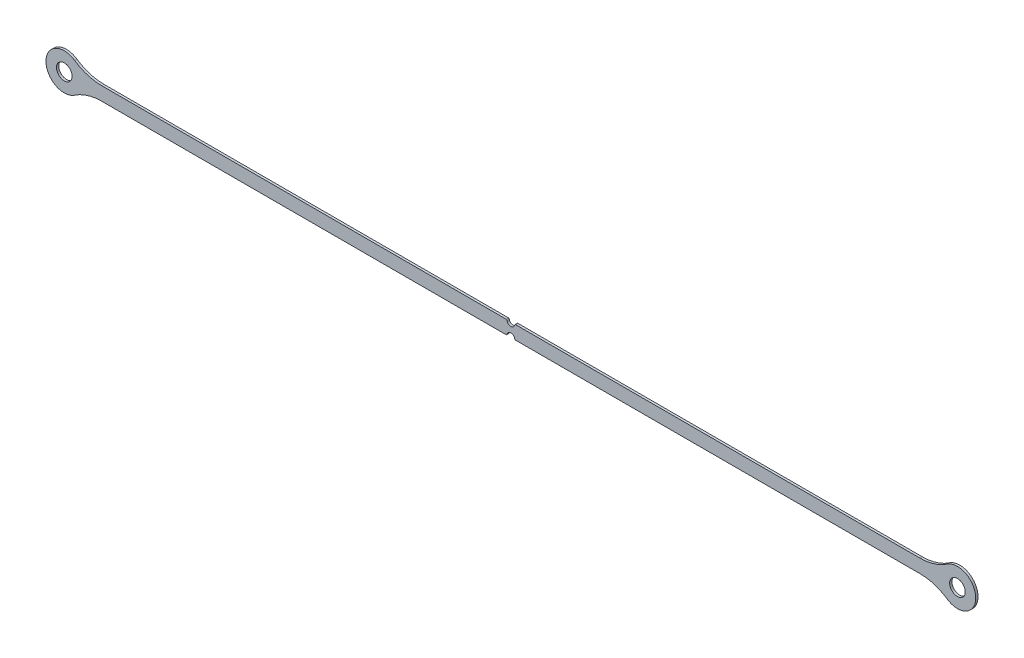
ISO-10303-21;
HEADER;
FILE_DESCRIPTION(('STEP AP214'),'2;1');
FILE_NAME('part.step','',(''),(''),'','','');
FILE_SCHEMA(('AUTOMOTIVE_DESIGN { 1 0 10303 214 1 1 1 1 }'));
ENDSEC;
DATA;
#1=APPLICATION_CONTEXT('core data for automotive mechanical design processes');
#2=APPLICATION_PROTOCOL_DEFINITION('international standard','automotive_design',2000,#1);
#3=PRODUCT_CONTEXT('',#1,'mechanical');
#4=PRODUCT('Part','Part','',(#3));
#5=PRODUCT_RELATED_PRODUCT_CATEGORY('part','',(#4));
#6=PRODUCT_DEFINITION_FORMATION('','',#4);
#7=PRODUCT_DEFINITION_CONTEXT('part definition',#1,'design');
#8=PRODUCT_DEFINITION('design','',#6,#7);
#9=PRODUCT_DEFINITION_SHAPE('','',#8);
#10=(LENGTH_UNIT() NAMED_UNIT(*) SI_UNIT(.MILLI.,.METRE.));
#11=(NAMED_UNIT(*) PLANE_ANGLE_UNIT() SI_UNIT($,.RADIAN.));
#12=(NAMED_UNIT(*) SI_UNIT($,.STERADIAN.) SOLID_ANGLE_UNIT());
#13=UNCERTAINTY_MEASURE_WITH_UNIT(LENGTH_MEASURE(1.E-05),#10,'distance_accuracy_value','');
#14=(GEOMETRIC_REPRESENTATION_CONTEXT(3) GLOBAL_UNCERTAINTY_ASSIGNED_CONTEXT((#13)) GLOBAL_UNIT_ASSIGNED_CONTEXT((#10,
#11,#12)) REPRESENTATION_CONTEXT('',''));
#15=CARTESIAN_POINT('',(0.,0.,0.));
#16=DIRECTION('',(0.,0.,1.));
#17=DIRECTION('',(1.,0.,0.));
#18=AXIS2_PLACEMENT_3D('',#15,#16,#17);
#19=CARTESIAN_POINT('',(-232.,0.,1.19999999999998));
#20=DIRECTION('',(0.,0.,-1.));
#21=DIRECTION('',(-1.,0.,0.));
#22=AXIS2_PLACEMENT_3D('',#19,#20,#21);
#23=CYLINDRICAL_SURFACE('',#22,9.49999999999999);
#24=CARTESIAN_POINT('',(-232.,0.,0.));
#25=DIRECTION('',(0.,0.,1.));
#26=DIRECTION('',(1.,0.,0.));
#27=AXIS2_PLACEMENT_3D('',#24,#25,#26);
#28=CIRCLE('',#27,9.49999999999999);
#29=CARTESIAN_POINT('',(-226.646344640446,-7.84782608695656,0.));
#30=VERTEX_POINT('',#29);
#31=CARTESIAN_POINT('',(-226.646344640446,7.84782608695644,-2.22044604925031E-13));
#32=VERTEX_POINT('',#31);
#33=EDGE_CURVE('E197',#30,#32,#28,.F.);
#34=ORIENTED_EDGE('',*,*,#33,.F.);
#35=DIRECTION('',(0.,0.,-1.));
#36=VECTOR('',#35,1.);
#37=CARTESIAN_POINT('',(-226.646344640446,-7.84782608695656,1.19999999999998));
#38=LINE('',#37,#36);
#39=CARTESIAN_POINT('',(-226.646344640446,-7.84782608695656,1.19999999999998));
#40=VERTEX_POINT('',#39);
#41=EDGE_CURVE('E13',#40,#30,#38,.T.);
#42=ORIENTED_EDGE('',*,*,#41,.F.);
#43=CARTESIAN_POINT('',(-232.,0.,1.19999999999998));
#44=DIRECTION('',(0.,0.,1.));
#45=DIRECTION('',(1.,0.,0.));
#46=AXIS2_PLACEMENT_3D('',#43,#44,#45);
#47=CIRCLE('',#46,9.49999999999999);
#48=CARTESIAN_POINT('',(-226.646344640446,7.84782608695644,1.19999999999987));
#49=VERTEX_POINT('',#48);
#50=EDGE_CURVE('E245',#40,#49,#47,.F.);
#51=ORIENTED_EDGE('',*,*,#50,.T.);
#52=DIRECTION('',(0.,0.,-1.));
#53=VECTOR('',#52,1.);
#54=CARTESIAN_POINT('',(-226.646344640446,7.84782608695644,1.19999999999987));
#55=LINE('',#54,#53);
#56=EDGE_CURVE('E63',#49,#32,#55,.T.);
#57=ORIENTED_EDGE('',*,*,#56,.T.);
#58=EDGE_LOOP('',(#34,#42,#51,#57));
#59=FACE_BOUND('',#58,.T.);
#60=ADVANCED_FACE('F47',(#59),#23,.T.);
#61=CARTESIAN_POINT('',(-212.557777904776,-28.5000000000001,1.19999999999998));
#62=DIRECTION('',(0.,0.,-1.));
#63=DIRECTION('',(-1.,0.,0.));
#64=AXIS2_PLACEMENT_3D('',#61,#62,#63);
#65=CYLINDRICAL_SURFACE('',#64,25.);
#66=CARTESIAN_POINT('',(-212.557777904776,-28.5000000000001,0.));
#67=DIRECTION('',(0.,0.,1.));
#68=DIRECTION('',(1.,0.,0.));
#69=AXIS2_PLACEMENT_3D('',#66,#67,#68);
#70=CIRCLE('',#69,25.);
#71=CARTESIAN_POINT('',(-212.557777904776,-3.50000000000006,0.));
#72=VERTEX_POINT('',#71);
#73=EDGE_CURVE('E199',#30,#72,#70,.F.);
#74=ORIENTED_EDGE('',*,*,#73,.T.);
#75=DIRECTION('',(0.,0.,-1.));
#76=VECTOR('',#75,1.);
#77=CARTESIAN_POINT('',(-212.557777904776,-3.50000000000006,1.19999999999998));
#78=LINE('',#77,#76);
#79=CARTESIAN_POINT('',(-212.557777904776,-3.50000000000006,1.19999999999998));
#80=VERTEX_POINT('',#79);
#81=EDGE_CURVE('E55',#80,#72,#78,.T.);
#82=ORIENTED_EDGE('',*,*,#81,.F.);
#83=CARTESIAN_POINT('',(-212.557777904776,-28.5000000000001,1.19999999999998));
#84=DIRECTION('',(0.,0.,1.));
#85=DIRECTION('',(1.,0.,0.));
#86=AXIS2_PLACEMENT_3D('',#83,#84,#85);
#87=CIRCLE('',#86,25.);
#88=EDGE_CURVE('E480',#40,#80,#87,.F.);
#89=ORIENTED_EDGE('',*,*,#88,.F.);
#90=ORIENTED_EDGE('',*,*,#41,.T.);
#91=EDGE_LOOP('',(#74,#82,#89,#90));
#92=FACE_BOUND('',#91,.T.);
#93=ADVANCED_FACE('F279',(#92),#65,.F.);
#94=CARTESIAN_POINT('',(0.,-3.5,1.19999999999998));
#95=DIRECTION('',(0.,-1.,0.));
#96=DIRECTION('',(1.,0.,0.));
#97=AXIS2_PLACEMENT_3D('',#94,#95,#96);
#98=PLANE('',#97);
#99=DIRECTION('',(-1.,0.,0.));
#100=VECTOR('',#99,1.);
#101=CARTESIAN_POINT('',(0.,-3.5,0.));
#102=LINE('',#101,#100);
#103=CARTESIAN_POINT('',(-2.50049995001,-3.5,0.));
#104=VERTEX_POINT('',#103);
#105=EDGE_CURVE('E202',#104,#72,#102,.T.);
#106=ORIENTED_EDGE('',*,*,#105,.F.);
#107=DIRECTION('',(0.,0.,-1.));
#108=VECTOR('',#107,1.);
#109=CARTESIAN_POINT('',(-2.50049995000996,-3.49999999999995,1.19999999999998));
#110=LINE('',#109,#108);
#111=CARTESIAN_POINT('',(-2.50049995000996,-3.49999999999995,1.19999999999998));
#112=VERTEX_POINT('',#111);
#113=EDGE_CURVE('E269',#112,#104,#110,.T.);
#114=ORIENTED_EDGE('',*,*,#113,.F.);
#115=DIRECTION('',(-1.,0.,0.));
#116=VECTOR('',#115,1.);
#117=CARTESIAN_POINT('',(0.,-3.5,1.19999999999998));
#118=LINE('',#117,#116);
#119=EDGE_CURVE('E276',#112,#80,#118,.T.);
#120=ORIENTED_EDGE('',*,*,#119,.T.);
#121=ORIENTED_EDGE('',*,*,#81,.T.);
#122=EDGE_LOOP('',(#106,#114,#120,#121));
#123=FACE_BOUND('',#122,.T.);
#124=ADVANCED_FACE('F274',(#123),#98,.T.);
#125=CARTESIAN_POINT('',(-2.50049995000999,-3.,1.19999999999998));
#126=DIRECTION('',(0.,0.,-1.));
#127=DIRECTION('',(-1.,0.,0.));
#128=AXIS2_PLACEMENT_3D('',#125,#126,#127);
#129=CYLINDRICAL_SURFACE('',#128,0.5);
#130=CARTESIAN_POINT('',(-2.50049995001,-3.,0.));
#131=DIRECTION('',(0.,0.,1.));
#132=DIRECTION('',(1.,0.,0.));
#133=AXIS2_PLACEMENT_3D('',#130,#131,#132);
#134=CIRCLE('',#133,0.5);
#135=CARTESIAN_POINT('',(-2.01020584216488,-3.0980392156863,0.));
#136=VERTEX_POINT('',#135);
#137=EDGE_CURVE('E205',#104,#136,#134,.T.);
#138=ORIENTED_EDGE('',*,*,#137,.T.);
#139=DIRECTION('',(0.,0.,-1.));
#140=VECTOR('',#139,1.);
#141=CARTESIAN_POINT('',(-2.01020584216487,-3.0980392156863,1.19999999999998));
#142=LINE('',#141,#140);
#143=CARTESIAN_POINT('',(-2.01020584216487,-3.0980392156863,1.19999999999998));
#144=VERTEX_POINT('',#143);
#145=EDGE_CURVE('E266',#144,#136,#142,.T.);
#146=ORIENTED_EDGE('',*,*,#145,.F.);
#147=CARTESIAN_POINT('',(-2.50049995000999,-3.,1.19999999999998));
#148=DIRECTION('',(0.,0.,1.));
#149=DIRECTION('',(1.,0.,0.));
#150=AXIS2_PLACEMENT_3D('',#147,#148,#149);
#151=CIRCLE('',#150,0.5);
#152=EDGE_CURVE('E297',#112,#144,#151,.T.);
#153=ORIENTED_EDGE('',*,*,#152,.F.);
#154=ORIENTED_EDGE('',*,*,#113,.T.);
#155=EDGE_LOOP('',(#138,#146,#153,#154));
#156=FACE_BOUND('',#155,.T.);
#157=ADVANCED_FACE('F287',(#156),#129,.T.);
#158=CARTESIAN_POINT('',(0.,-3.5,1.19999999999998));
#159=DIRECTION('',(0.,0.,-1.));
#160=DIRECTION('',(-1.,0.,0.));
#161=AXIS2_PLACEMENT_3D('',#158,#159,#160);
#162=CYLINDRICAL_SURFACE('',#161,2.05);
#163=CARTESIAN_POINT('',(0.,-3.5,0.));
#164=DIRECTION('',(0.,0.,1.));
#165=DIRECTION('',(1.,0.,0.));
#166=AXIS2_PLACEMENT_3D('',#163,#164,#165);
#167=CIRCLE('',#166,2.05);
#168=CARTESIAN_POINT('',(2.01020584216491,-3.0980392156863,0.));
#169=VERTEX_POINT('',#168);
#170=EDGE_CURVE('E207',#136,#169,#167,.F.);
#171=ORIENTED_EDGE('',*,*,#170,.T.);
#172=DIRECTION('',(0.,0.,-1.));
#173=VECTOR('',#172,1.);
#174=CARTESIAN_POINT('',(2.01020584216492,-3.0980392156863,1.19999999999998));
#175=LINE('',#174,#173);
#176=CARTESIAN_POINT('',(2.01020584216492,-3.0980392156863,1.19999999999998));
#177=VERTEX_POINT('',#176);
#178=EDGE_CURVE('E264',#177,#169,#175,.T.);
#179=ORIENTED_EDGE('',*,*,#178,.F.);
#180=CARTESIAN_POINT('',(0.,-3.5,1.19999999999998));
#181=DIRECTION('',(0.,0.,1.));
#182=DIRECTION('',(1.,0.,0.));
#183=AXIS2_PLACEMENT_3D('',#180,#181,#182);
#184=CIRCLE('',#183,2.05);
#185=EDGE_CURVE('E293',#144,#177,#184,.F.);
#186=ORIENTED_EDGE('',*,*,#185,.F.);
#187=ORIENTED_EDGE('',*,*,#145,.T.);
#188=EDGE_LOOP('',(#171,#179,#186,#187));
#189=FACE_BOUND('',#188,.T.);
#190=ADVANCED_FACE('F291',(#189),#162,.F.);
#191=CARTESIAN_POINT('',(2.50049995000999,-3.,1.19999999999998));
#192=DIRECTION('',(0.,0.,-1.));
#193=DIRECTION('',(-1.,0.,0.));
#194=AXIS2_PLACEMENT_3D('',#191,#192,#193);
#195=CYLINDRICAL_SURFACE('',#194,0.5);
#196=CARTESIAN_POINT('',(2.50049995000998,-3.,0.));
#197=DIRECTION('',(0.,0.,1.));
#198=DIRECTION('',(1.,0.,0.));
#199=AXIS2_PLACEMENT_3D('',#196,#197,#198);
#200=CIRCLE('',#199,0.5);
#201=CARTESIAN_POINT('',(2.50049995001,-3.5,0.));
#202=VERTEX_POINT('',#201);
#203=EDGE_CURVE('E210',#202,#169,#200,.F.);
#204=ORIENTED_EDGE('',*,*,#203,.F.);
#205=DIRECTION('',(0.,0.,-1.));
#206=VECTOR('',#205,1.);
#207=CARTESIAN_POINT('',(2.50049995001002,-3.49999999999995,1.19999999999998));
#208=LINE('',#207,#206);
#209=CARTESIAN_POINT('',(2.50049995001002,-3.49999999999995,1.19999999999998));
#210=VERTEX_POINT('',#209);
#211=EDGE_CURVE('E262',#210,#202,#208,.T.);
#212=ORIENTED_EDGE('',*,*,#211,.F.);
#213=CARTESIAN_POINT('',(2.50049995000999,-3.,1.19999999999998));
#214=DIRECTION('',(0.,0.,1.));
#215=DIRECTION('',(1.,0.,0.));
#216=AXIS2_PLACEMENT_3D('',#213,#214,#215);
#217=CIRCLE('',#216,0.5);
#218=EDGE_CURVE('E296',#210,#177,#217,.F.);
#219=ORIENTED_EDGE('',*,*,#218,.T.);
#220=ORIENTED_EDGE('',*,*,#178,.T.);
#221=EDGE_LOOP('',(#204,#212,#219,#220));
#222=FACE_BOUND('',#221,.T.);
#223=ADVANCED_FACE('F350',(#222),#195,.T.);
#224=CARTESIAN_POINT('',(0.,-3.5,1.19999999999998));
#225=DIRECTION('',(0.,1.,0.));
#226=DIRECTION('',(-1.,0.,0.));
#227=AXIS2_PLACEMENT_3D('',#224,#225,#226);
#228=PLANE('',#227);
#229=DIRECTION('',(1.,0.,0.));
#230=VECTOR('',#229,1.);
#231=CARTESIAN_POINT('',(0.,-3.5,0.));
#232=LINE('',#231,#230);
#233=CARTESIAN_POINT('',(212.557777904776,-3.5,0.));
#234=VERTEX_POINT('',#233);
#235=EDGE_CURVE('E213',#202,#234,#232,.T.);
#236=ORIENTED_EDGE('',*,*,#235,.T.);
#237=DIRECTION('',(0.,0.,-1.));
#238=VECTOR('',#237,1.);
#239=CARTESIAN_POINT('',(212.557777904776,-3.5,1.19999999999998));
#240=LINE('',#239,#238);
#241=CARTESIAN_POINT('',(212.557777904776,-3.5,1.19999999999998));
#242=VERTEX_POINT('',#241);
#243=EDGE_CURVE('E260',#242,#234,#240,.T.);
#244=ORIENTED_EDGE('',*,*,#243,.F.);
#245=DIRECTION('',(1.,0.,0.));
#246=VECTOR('',#245,1.);
#247=CARTESIAN_POINT('',(0.,-3.5,1.19999999999998));
#248=LINE('',#247,#246);
#249=EDGE_CURVE('E299',#210,#242,#248,.T.);
#250=ORIENTED_EDGE('',*,*,#249,.F.);
#251=ORIENTED_EDGE('',*,*,#211,.T.);
#252=EDGE_LOOP('',(#236,#244,#250,#251));
#253=FACE_BOUND('',#252,.T.);
#254=ADVANCED_FACE('F353',(#253),#228,.F.);
#255=CARTESIAN_POINT('',(212.557777904776,-28.4999999999999,1.19999999999998));
#256=DIRECTION('',(0.,0.,-1.));
#257=DIRECTION('',(-1.,0.,0.));
#258=AXIS2_PLACEMENT_3D('',#255,#256,#257);
#259=CYLINDRICAL_SURFACE('',#258,25.);
#260=CARTESIAN_POINT('',(212.557777904776,-28.4999999999999,0.));
#261=DIRECTION('',(0.,0.,1.));
#262=DIRECTION('',(1.,0.,0.));
#263=AXIS2_PLACEMENT_3D('',#260,#261,#262);
#264=CIRCLE('',#263,25.);
#265=CARTESIAN_POINT('',(226.646344640446,-7.84782608695656,0.));
#266=VERTEX_POINT('',#265);
#267=EDGE_CURVE('E216',#266,#234,#264,.T.);
#268=ORIENTED_EDGE('',*,*,#267,.F.);
#269=DIRECTION('',(0.,0.,-1.));
#270=VECTOR('',#269,1.);
#271=CARTESIAN_POINT('',(226.646344640446,-7.84782608695656,1.19999999999998));
#272=LINE('',#271,#270);
#273=CARTESIAN_POINT('',(226.646344640446,-7.84782608695656,1.19999999999998));
#274=VERTEX_POINT('',#273);
#275=EDGE_CURVE('E258',#274,#266,#272,.T.);
#276=ORIENTED_EDGE('',*,*,#275,.F.);
#277=CARTESIAN_POINT('',(212.557777904776,-28.4999999999999,1.19999999999998));
#278=DIRECTION('',(0.,0.,1.));
#279=DIRECTION('',(1.,0.,0.));
#280=AXIS2_PLACEMENT_3D('',#277,#278,#279);
#281=CIRCLE('',#280,25.);
#282=EDGE_CURVE('E305',#274,#242,#281,.T.);
#283=ORIENTED_EDGE('',*,*,#282,.T.);
#284=ORIENTED_EDGE('',*,*,#243,.T.);
#285=EDGE_LOOP('',(#268,#276,#283,#284));
#286=FACE_BOUND('',#285,.T.);
#287=ADVANCED_FACE('F357',(#286),#259,.F.);
#288=CARTESIAN_POINT('',(232.,0.,1.19999999999987));
#289=DIRECTION('',(0.,0.,-1.));
#290=DIRECTION('',(-1.,0.,0.));
#291=AXIS2_PLACEMENT_3D('',#288,#289,#290);
#292=CYLINDRICAL_SURFACE('',#291,9.49999999999999);
#293=CARTESIAN_POINT('',(232.,0.,-2.22044604925031E-13));
#294=DIRECTION('',(0.,0.,1.));
#295=DIRECTION('',(1.,0.,0.));
#296=AXIS2_PLACEMENT_3D('',#293,#294,#295);
#297=CIRCLE('',#296,9.49999999999999);
#298=CARTESIAN_POINT('',(226.646344640446,7.8478260869565,0.));
#299=VERTEX_POINT('',#298);
#300=EDGE_CURVE('E219',#266,#299,#297,.T.);
#301=ORIENTED_EDGE('',*,*,#300,.T.);
#302=DIRECTION('',(0.,0.,-1.));
#303=VECTOR('',#302,1.);
#304=CARTESIAN_POINT('',(226.646344640446,7.8478260869565,1.19999999999998));
#305=LINE('',#304,#303);
#306=CARTESIAN_POINT('',(226.646344640446,7.8478260869565,1.19999999999998));
#307=VERTEX_POINT('',#306);
#308=EDGE_CURVE('E255',#307,#299,#305,.T.);
#309=ORIENTED_EDGE('',*,*,#308,.F.);
#310=CARTESIAN_POINT('',(232.,0.,1.19999999999987));
#311=DIRECTION('',(0.,0.,1.));
#312=DIRECTION('',(1.,0.,0.));
#313=AXIS2_PLACEMENT_3D('',#310,#311,#312);
#314=CIRCLE('',#313,9.49999999999999);
#315=EDGE_CURVE('E308',#274,#307,#314,.T.);
#316=ORIENTED_EDGE('',*,*,#315,.F.);
#317=ORIENTED_EDGE('',*,*,#275,.T.);
#318=EDGE_LOOP('',(#301,#309,#316,#317));
#319=FACE_BOUND('',#318,.T.);
#320=ADVANCED_FACE('F361',(#319),#292,.T.);
#321=CARTESIAN_POINT('',(212.557777904776,28.5,1.19999999999998));
#322=DIRECTION('',(0.,0.,-1.));
#323=DIRECTION('',(-1.,0.,0.));
#324=AXIS2_PLACEMENT_3D('',#321,#322,#323);
#325=CYLINDRICAL_SURFACE('',#324,25.);
#326=CARTESIAN_POINT('',(212.557777904776,28.5,0.));
#327=DIRECTION('',(0.,0.,1.));
#328=DIRECTION('',(1.,0.,0.));
#329=AXIS2_PLACEMENT_3D('',#326,#327,#328);
#330=CIRCLE('',#329,25.);
#331=CARTESIAN_POINT('',(212.557777904776,3.5,0.));
#332=VERTEX_POINT('',#331);
#333=EDGE_CURVE('E221',#299,#332,#330,.F.);
#334=ORIENTED_EDGE('',*,*,#333,.T.);
#335=DIRECTION('',(0.,0.,-1.));
#336=VECTOR('',#335,1.);
#337=CARTESIAN_POINT('',(212.557777904776,3.5,1.19999999999998));
#338=LINE('',#337,#336);
#339=CARTESIAN_POINT('',(212.557777904776,3.5,1.19999999999998));
#340=VERTEX_POINT('',#339);
#341=EDGE_CURVE('E253',#340,#332,#338,.T.);
#342=ORIENTED_EDGE('',*,*,#341,.F.);
#343=CARTESIAN_POINT('',(212.557777904776,28.5,1.19999999999998));
#344=DIRECTION('',(0.,0.,1.));
#345=DIRECTION('',(1.,0.,0.));
#346=AXIS2_PLACEMENT_3D('',#343,#344,#345);
#347=CIRCLE('',#346,25.);
#348=EDGE_CURVE('E310',#307,#340,#347,.F.);
#349=ORIENTED_EDGE('',*,*,#348,.F.);
#350=ORIENTED_EDGE('',*,*,#308,.T.);
#351=EDGE_LOOP('',(#334,#342,#349,#350));
#352=FACE_BOUND('',#351,.T.);
#353=ADVANCED_FACE('F365',(#352),#325,.F.);
#354=CARTESIAN_POINT('',(0.,3.49999999999995,1.19999999999998));
#355=DIRECTION('',(0.,1.,0.));
#356=DIRECTION('',(-1.,0.,0.));
#357=AXIS2_PLACEMENT_3D('',#354,#355,#356);
#358=PLANE('',#357);
#359=DIRECTION('',(1.,0.,0.));
#360=VECTOR('',#359,1.);
#361=CARTESIAN_POINT('',(0.,3.49999999999995,0.));
#362=LINE('',#361,#360);
#363=CARTESIAN_POINT('',(2.50049995001006,3.50000000000006,0.));
#364=VERTEX_POINT('',#363);
#365=EDGE_CURVE('E224',#364,#332,#362,.T.);
#366=ORIENTED_EDGE('',*,*,#365,.F.);
#367=DIRECTION('',(0.,0.,-1.));
#368=VECTOR('',#367,1.);
#369=CARTESIAN_POINT('',(2.50049995001007,3.50000000000006,1.19999999999998));
#370=LINE('',#369,#368);
#371=CARTESIAN_POINT('',(2.50049995001007,3.50000000000006,1.19999999999998));
#372=VERTEX_POINT('',#371);
#373=EDGE_CURVE('E251',#372,#364,#370,.T.);
#374=ORIENTED_EDGE('',*,*,#373,.F.);
#375=DIRECTION('',(1.,0.,0.));
#376=VECTOR('',#375,1.);
#377=CARTESIAN_POINT('',(0.,3.49999999999995,1.19999999999998));
#378=LINE('',#377,#376);
#379=EDGE_CURVE('E312',#372,#340,#378,.T.);
#380=ORIENTED_EDGE('',*,*,#379,.T.);
#381=ORIENTED_EDGE('',*,*,#341,.T.);
#382=EDGE_LOOP('',(#366,#374,#380,#381));
#383=FACE_BOUND('',#382,.T.);
#384=ADVANCED_FACE('F369',(#383),#358,.T.);
#385=CARTESIAN_POINT('',(2.50049995001005,3.,1.19999999999998));
#386=DIRECTION('',(0.,0.,-1.));
#387=DIRECTION('',(-1.,0.,0.));
#388=AXIS2_PLACEMENT_3D('',#385,#386,#387);
#389=CYLINDRICAL_SURFACE('',#388,0.5);
#390=CARTESIAN_POINT('',(2.50049995001,3.,0.));
#391=DIRECTION('',(0.,0.,1.));
#392=DIRECTION('',(1.,0.,0.));
#393=AXIS2_PLACEMENT_3D('',#390,#391,#392);
#394=CIRCLE('',#393,0.5);
#395=CARTESIAN_POINT('',(2.01020584216488,3.0980392156863,0.));
#396=VERTEX_POINT('',#395);
#397=EDGE_CURVE('E227',#364,#396,#394,.T.);
#398=ORIENTED_EDGE('',*,*,#397,.T.);
#399=DIRECTION('',(0.,0.,-1.));
#400=VECTOR('',#399,1.);
#401=CARTESIAN_POINT('',(2.01020584216489,3.0980392156863,1.19999999999998));
#402=LINE('',#401,#400);
#403=CARTESIAN_POINT('',(2.01020584216489,3.0980392156863,1.19999999999998));
#404=VERTEX_POINT('',#403);
#405=EDGE_CURVE('E249',#404,#396,#402,.T.);
#406=ORIENTED_EDGE('',*,*,#405,.F.);
#407=CARTESIAN_POINT('',(2.50049995001005,3.,1.19999999999998));
#408=DIRECTION('',(0.,0.,1.));
#409=DIRECTION('',(1.,0.,0.));
#410=AXIS2_PLACEMENT_3D('',#407,#408,#409);
#411=CIRCLE('',#410,0.5);
#412=EDGE_CURVE('E186',#372,#404,#411,.T.);
#413=ORIENTED_EDGE('',*,*,#412,.F.);
#414=ORIENTED_EDGE('',*,*,#373,.T.);
#415=EDGE_LOOP('',(#398,#406,#413,#414));
#416=FACE_BOUND('',#415,.T.);
#417=ADVANCED_FACE('F318',(#416),#389,.T.);
#418=CARTESIAN_POINT('',(0.,3.49999999999995,1.19999999999998));
#419=DIRECTION('',(0.,0.,-1.));
#420=DIRECTION('',(-1.,0.,0.));
#421=AXIS2_PLACEMENT_3D('',#418,#419,#420);
#422=CYLINDRICAL_SURFACE('',#421,2.05);
#423=CARTESIAN_POINT('',(0.,3.49999999999995,0.));
#424=DIRECTION('',(0.,0.,1.));
#425=DIRECTION('',(1.,0.,0.));
#426=AXIS2_PLACEMENT_3D('',#423,#424,#425);
#427=CIRCLE('',#426,2.05);
#428=CARTESIAN_POINT('',(-2.01020584216488,3.09803921568619,0.));
#429=VERTEX_POINT('',#428);
#430=EDGE_CURVE('E230',#429,#396,#427,.T.);
#431=ORIENTED_EDGE('',*,*,#430,.F.);
#432=DIRECTION('',(0.,0.,-1.));
#433=VECTOR('',#432,1.);
#434=CARTESIAN_POINT('',(-2.01020584216487,3.09803921568619,1.19999999999998));
#435=LINE('',#434,#433);
#436=CARTESIAN_POINT('',(-2.01020584216487,3.09803921568619,1.19999999999998));
#437=VERTEX_POINT('',#436);
#438=EDGE_CURVE('E171',#437,#429,#435,.T.);
#439=ORIENTED_EDGE('',*,*,#438,.F.);
#440=CARTESIAN_POINT('',(0.,3.49999999999995,1.19999999999998));
#441=DIRECTION('',(0.,0.,1.));
#442=DIRECTION('',(1.,0.,0.));
#443=AXIS2_PLACEMENT_3D('',#440,#441,#442);
#444=CIRCLE('',#443,2.05);
#445=EDGE_CURVE('E184',#437,#404,#444,.T.);
#446=ORIENTED_EDGE('',*,*,#445,.T.);
#447=ORIENTED_EDGE('',*,*,#405,.T.);
#448=EDGE_LOOP('',(#431,#439,#446,#447));
#449=FACE_BOUND('',#448,.T.);
#450=ADVANCED_FACE('F322',(#449),#422,.F.);
#451=CARTESIAN_POINT('',(-2.50049995000999,3.,1.19999999999998));
#452=DIRECTION('',(0.,0.,-1.));
#453=DIRECTION('',(-1.,0.,0.));
#454=AXIS2_PLACEMENT_3D('',#451,#452,#453);
#455=CYLINDRICAL_SURFACE('',#454,0.5);
#456=CARTESIAN_POINT('',(-2.50049995001,3.,0.));
#457=DIRECTION('',(0.,0.,1.));
#458=DIRECTION('',(1.,0.,0.));
#459=AXIS2_PLACEMENT_3D('',#456,#457,#458);
#460=CIRCLE('',#459,0.5);
#461=CARTESIAN_POINT('',(-2.50049995000998,3.5,0.));
#462=VERTEX_POINT('',#461);
#463=EDGE_CURVE('E168',#462,#429,#460,.F.);
#464=ORIENTED_EDGE('',*,*,#463,.F.);
#465=DIRECTION('',(0.,0.,-1.));
#466=VECTOR('',#465,1.);
#467=CARTESIAN_POINT('',(-2.50049995000994,3.50000000000006,1.19999999999998));
#468=LINE('',#467,#466);
#469=CARTESIAN_POINT('',(-2.50049995000994,3.50000000000006,1.19999999999998));
#470=VERTEX_POINT('',#469);
#471=EDGE_CURVE('E162',#470,#462,#468,.T.);
#472=ORIENTED_EDGE('',*,*,#471,.F.);
#473=CARTESIAN_POINT('',(-2.50049995000999,3.,1.19999999999998));
#474=DIRECTION('',(0.,0.,1.));
#475=DIRECTION('',(1.,0.,0.));
#476=AXIS2_PLACEMENT_3D('',#473,#474,#475);
#477=CIRCLE('',#476,0.5);
#478=EDGE_CURVE('E166',#470,#437,#477,.F.);
#479=ORIENTED_EDGE('',*,*,#478,.T.);
#480=ORIENTED_EDGE('',*,*,#438,.T.);
#481=EDGE_LOOP('',(#464,#472,#479,#480));
#482=FACE_BOUND('',#481,.T.);
#483=ADVANCED_FACE('F164',(#482),#455,.T.);
#484=CARTESIAN_POINT('',(0.,3.49999999999995,1.19999999999998));
#485=DIRECTION('',(0.,-1.,0.));
#486=DIRECTION('',(1.,0.,0.));
#487=AXIS2_PLACEMENT_3D('',#484,#485,#486);
#488=PLANE('',#487);
#489=DIRECTION('',(-1.,0.,0.));
#490=VECTOR('',#489,1.);
#491=CARTESIAN_POINT('',(0.,3.49999999999995,0.));
#492=LINE('',#491,#490);
#493=CARTESIAN_POINT('',(-212.557777904776,3.49999999999995,0.));
#494=VERTEX_POINT('',#493);
#495=EDGE_CURVE('E234',#462,#494,#492,.T.);
#496=ORIENTED_EDGE('',*,*,#495,.T.);
#497=DIRECTION('',(0.,0.,-1.));
#498=VECTOR('',#497,1.);
#499=CARTESIAN_POINT('',(-212.557777904776,3.49999999999995,1.19999999999998));
#500=LINE('',#499,#498);
#501=CARTESIAN_POINT('',(-212.557777904776,3.49999999999995,1.19999999999998));
#502=VERTEX_POINT('',#501);
#503=EDGE_CURVE('E113',#502,#494,#500,.T.);
#504=ORIENTED_EDGE('',*,*,#503,.F.);
#505=DIRECTION('',(-1.,0.,0.));
#506=VECTOR('',#505,1.);
#507=CARTESIAN_POINT('',(0.,3.49999999999995,1.19999999999998));
#508=LINE('',#507,#506);
#509=EDGE_CURVE('E173',#470,#502,#508,.T.);
#510=ORIENTED_EDGE('',*,*,#509,.F.);
#511=ORIENTED_EDGE('',*,*,#471,.T.);
#512=EDGE_LOOP('',(#496,#504,#510,#511));
#513=FACE_BOUND('',#512,.T.);
#514=ADVANCED_FACE('F174',(#513),#488,.F.);
#515=CARTESIAN_POINT('',(232.,0.,1.19999999999987));
#516=DIRECTION('',(0.,0.,-1.));
#517=DIRECTION('',(-1.,0.,0.));
#518=AXIS2_PLACEMENT_3D('',#515,#516,#517);
#519=CYLINDRICAL_SURFACE('',#518,4.04999999999999);
#520=CARTESIAN_POINT('',(232.,0.,1.19999999999987));
#521=DIRECTION('',(0.,0.,1.));
#522=DIRECTION('',(1.,0.,0.));
#523=AXIS2_PLACEMENT_3D('',#520,#521,#522);
#524=CIRCLE('',#523,4.04999999999999);
#525=CARTESIAN_POINT('',(236.05,0.,1.19999999999987));
#526=VERTEX_POINT('',#525);
#527=EDGE_CURVE('E191',#526,#526,#524,.T.);
#528=ORIENTED_EDGE('',*,*,#527,.T.);
#529=EDGE_LOOP('',(#528));
#530=FACE_BOUND('',#529,.T.);
#531=CARTESIAN_POINT('',(232.,0.,-2.22044604925031E-13));
#532=DIRECTION('',(0.,0.,1.));
#533=DIRECTION('',(1.,0.,0.));
#534=AXIS2_PLACEMENT_3D('',#531,#532,#533);
#535=CIRCLE('',#534,4.04999999999999);
#536=CARTESIAN_POINT('',(236.05,0.,-2.22044604925031E-13));
#537=VERTEX_POINT('',#536);
#538=EDGE_CURVE('E239',#537,#537,#535,.T.);
#539=ORIENTED_EDGE('',*,*,#538,.F.);
#540=EDGE_LOOP('',(#539));
#541=FACE_BOUND('',#540,.T.);
#542=ADVANCED_FACE('F326',(#530,#541),#519,.F.);
#543=CARTESIAN_POINT('',(-212.557777904776,28.4999999999999,1.19999999999998));
#544=DIRECTION('',(0.,0.,-1.));
#545=DIRECTION('',(-1.,0.,0.));
#546=AXIS2_PLACEMENT_3D('',#543,#544,#545);
#547=CYLINDRICAL_SURFACE('',#546,25.);
#548=CARTESIAN_POINT('',(-212.557777904776,28.4999999999999,0.));
#549=DIRECTION('',(0.,0.,1.));
#550=DIRECTION('',(1.,0.,0.));
#551=AXIS2_PLACEMENT_3D('',#548,#549,#550);
#552=CIRCLE('',#551,25.);
#553=EDGE_CURVE('E236',#32,#494,#552,.T.);
#554=ORIENTED_EDGE('',*,*,#553,.F.);
#555=ORIENTED_EDGE('',*,*,#56,.F.);
#556=CARTESIAN_POINT('',(-212.557777904776,28.4999999999999,1.19999999999998));
#557=DIRECTION('',(0.,0.,1.));
#558=DIRECTION('',(1.,0.,0.));
#559=AXIS2_PLACEMENT_3D('',#556,#557,#558);
#560=CIRCLE('',#559,25.);
#561=EDGE_CURVE('E177',#49,#502,#560,.T.);
#562=ORIENTED_EDGE('',*,*,#561,.T.);
#563=ORIENTED_EDGE('',*,*,#503,.T.);
#564=EDGE_LOOP('',(#554,#555,#562,#563));
#565=FACE_BOUND('',#564,.T.);
#566=ADVANCED_FACE('F323',(#565),#547,.F.);
#567=CARTESIAN_POINT('',(-232.,0.,1.19999999999998));
#568=DIRECTION('',(0.,0.,-1.));
#569=DIRECTION('',(-1.,0.,0.));
#570=AXIS2_PLACEMENT_3D('',#567,#568,#569);
#571=CYLINDRICAL_SURFACE('',#570,4.04999999999999);
#572=CARTESIAN_POINT('',(-232.,0.,1.19999999999998));
#573=DIRECTION('',(0.,0.,1.));
#574=DIRECTION('',(1.,0.,0.));
#575=AXIS2_PLACEMENT_3D('',#572,#573,#574);
#576=CIRCLE('',#575,4.04999999999999);
#577=CARTESIAN_POINT('',(-227.95,0.,1.19999999999998));
#578=VERTEX_POINT('',#577);
#579=EDGE_CURVE('E194',#578,#578,#576,.F.);
#580=ORIENTED_EDGE('',*,*,#579,.F.);
#581=EDGE_LOOP('',(#580));
#582=FACE_BOUND('',#581,.T.);
#583=CARTESIAN_POINT('',(-232.,0.,0.));
#584=DIRECTION('',(0.,0.,1.));
#585=DIRECTION('',(1.,0.,0.));
#586=AXIS2_PLACEMENT_3D('',#583,#584,#585);
#587=CIRCLE('',#586,4.04999999999999);
#588=CARTESIAN_POINT('',(-227.95,0.,0.));
#589=VERTEX_POINT('',#588);
#590=EDGE_CURVE('E242',#589,#589,#587,.F.);
#591=ORIENTED_EDGE('',*,*,#590,.T.);
#592=EDGE_LOOP('',(#591));
#593=FACE_BOUND('',#592,.T.);
#594=ADVANCED_FACE('F325',(#582,#593),#571,.F.);
#595=CARTESIAN_POINT('',(0.,0.,1.19999999999998));
#596=DIRECTION('',(0.,0.,1.));
#597=DIRECTION('',(1.,0.,0.));
#598=AXIS2_PLACEMENT_3D('',#595,#596,#597);
#599=PLANE('',#598);
#600=ORIENTED_EDGE('',*,*,#50,.F.);
#601=ORIENTED_EDGE('',*,*,#88,.T.);
#602=ORIENTED_EDGE('',*,*,#119,.F.);
#603=ORIENTED_EDGE('',*,*,#152,.T.);
#604=ORIENTED_EDGE('',*,*,#185,.T.);
#605=ORIENTED_EDGE('',*,*,#218,.F.);
#606=ORIENTED_EDGE('',*,*,#249,.T.);
#607=ORIENTED_EDGE('',*,*,#282,.F.);
#608=ORIENTED_EDGE('',*,*,#315,.T.);
#609=ORIENTED_EDGE('',*,*,#348,.T.);
#610=ORIENTED_EDGE('',*,*,#379,.F.);
#611=ORIENTED_EDGE('',*,*,#412,.T.);
#612=ORIENTED_EDGE('',*,*,#445,.F.);
#613=ORIENTED_EDGE('',*,*,#478,.F.);
#614=ORIENTED_EDGE('',*,*,#509,.T.);
#615=ORIENTED_EDGE('',*,*,#561,.F.);
#616=EDGE_LOOP('',(#600,#601,#602,#603,#604,#605,#606,#607,#608,#609,#610,#611,#612,#613,#614,#615));
#617=FACE_BOUND('',#616,.T.);
#618=ORIENTED_EDGE('',*,*,#527,.F.);
#619=EDGE_LOOP('',(#618));
#620=FACE_BOUND('',#619,.T.);
#621=ORIENTED_EDGE('',*,*,#579,.T.);
#622=EDGE_LOOP('',(#621));
#623=FACE_BOUND('',#622,.T.);
#624=ADVANCED_FACE('F181',(#617,#620,#623),#599,.T.);
#625=CARTESIAN_POINT('',(0.,0.,0.));
#626=DIRECTION('',(0.,0.,1.));
#627=DIRECTION('',(1.,0.,0.));
#628=AXIS2_PLACEMENT_3D('',#625,#626,#627);
#629=PLANE('',#628);
#630=ORIENTED_EDGE('',*,*,#33,.T.);
#631=ORIENTED_EDGE('',*,*,#553,.T.);
#632=ORIENTED_EDGE('',*,*,#495,.F.);
#633=ORIENTED_EDGE('',*,*,#463,.T.);
#634=ORIENTED_EDGE('',*,*,#430,.T.);
#635=ORIENTED_EDGE('',*,*,#397,.F.);
#636=ORIENTED_EDGE('',*,*,#365,.T.);
#637=ORIENTED_EDGE('',*,*,#333,.F.);
#638=ORIENTED_EDGE('',*,*,#300,.F.);
#639=ORIENTED_EDGE('',*,*,#267,.T.);
#640=ORIENTED_EDGE('',*,*,#235,.F.);
#641=ORIENTED_EDGE('',*,*,#203,.T.);
#642=ORIENTED_EDGE('',*,*,#170,.F.);
#643=ORIENTED_EDGE('',*,*,#137,.F.);
#644=ORIENTED_EDGE('',*,*,#105,.T.);
#645=ORIENTED_EDGE('',*,*,#73,.F.);
#646=EDGE_LOOP('',(#630,#631,#632,#633,#634,#635,#636,#637,#638,#639,#640,#641,#642,#643,#644,#645));
#647=FACE_BOUND('',#646,.T.);
#648=ORIENTED_EDGE('',*,*,#538,.T.);
#649=EDGE_LOOP('',(#648));
#650=FACE_BOUND('',#649,.T.);
#651=ORIENTED_EDGE('',*,*,#590,.F.);
#652=EDGE_LOOP('',(#651));
#653=FACE_BOUND('',#652,.T.);
#654=ADVANCED_FACE('F282',(#647,#650,#653),#629,.F.);
#655=CLOSED_SHELL('',(#60,#93,#124,#157,#190,#223,#254,#287,#320,#353,#384,#417,#450,#483,#514,
#542,#566,#594,#624,#654));
#656=MANIFOLD_SOLID_BREP('B2',#655);
#657=ADVANCED_BREP_SHAPE_REPRESENTATION('',(#18,#656),#14);
#658=SHAPE_DEFINITION_REPRESENTATION(#9,#657);
ENDSEC;
END-ISO-10303-21;
